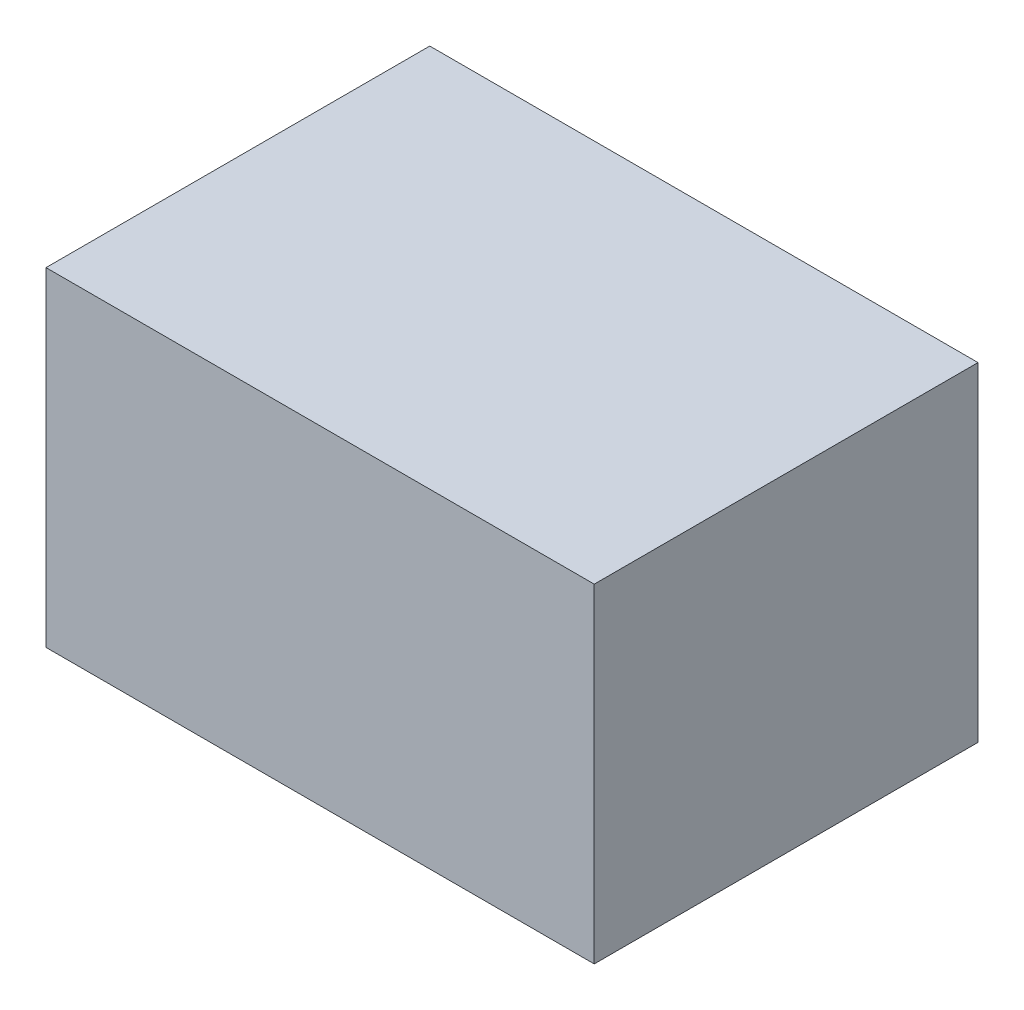
ISO-10303-21;
HEADER;
FILE_DESCRIPTION(('STEP AP214'),'2;1');
FILE_NAME('part.step','',(''),(''),'','','');
FILE_SCHEMA(('AUTOMOTIVE_DESIGN { 1 0 10303 214 1 1 1 1 }'));
ENDSEC;
DATA;
#1=APPLICATION_CONTEXT('core data for automotive mechanical design processes');
#2=APPLICATION_PROTOCOL_DEFINITION('international standard','automotive_design',2000,#1);
#3=PRODUCT_CONTEXT('',#1,'mechanical');
#4=PRODUCT('Part','Part','',(#3));
#5=PRODUCT_RELATED_PRODUCT_CATEGORY('part','',(#4));
#6=PRODUCT_DEFINITION_FORMATION('','',#4);
#7=PRODUCT_DEFINITION_CONTEXT('part definition',#1,'design');
#8=PRODUCT_DEFINITION('design','',#6,#7);
#9=PRODUCT_DEFINITION_SHAPE('','',#8);
#10=(LENGTH_UNIT() NAMED_UNIT(*) SI_UNIT(.MILLI.,.METRE.));
#11=(NAMED_UNIT(*) PLANE_ANGLE_UNIT() SI_UNIT($,.RADIAN.));
#12=(NAMED_UNIT(*) SI_UNIT($,.STERADIAN.) SOLID_ANGLE_UNIT());
#13=UNCERTAINTY_MEASURE_WITH_UNIT(LENGTH_MEASURE(1.E-05),#10,'distance_accuracy_value','');
#14=(GEOMETRIC_REPRESENTATION_CONTEXT(3) GLOBAL_UNCERTAINTY_ASSIGNED_CONTEXT((#13)) GLOBAL_UNIT_ASSIGNED_CONTEXT((#10,
#11,#12)) REPRESENTATION_CONTEXT('',''));
#15=CARTESIAN_POINT('',(0.,0.,0.));
#16=DIRECTION('',(0.,0.,1.));
#17=DIRECTION('',(1.,0.,0.));
#18=AXIS2_PLACEMENT_3D('',#15,#16,#17);
#19=CARTESIAN_POINT('',(10.,0.,0.));
#20=DIRECTION('',(0.,0.,-1.));
#21=DIRECTION('',(-1.,0.,0.));
#22=AXIS2_PLACEMENT_3D('',#19,#20,#21);
#23=PLANE('',#22);
#24=DIRECTION('',(0.,-1.,0.));
#25=VECTOR('',#24,1.);
#26=CARTESIAN_POINT('',(0.,0.,0.));
#27=LINE('',#26,#25);
#28=CARTESIAN_POINT('',(0.,6.,0.));
#29=VERTEX_POINT('',#28);
#30=CARTESIAN_POINT('',(0.,0.,0.));
#31=VERTEX_POINT('',#30);
#32=EDGE_CURVE('E107',#29,#31,#27,.T.);
#33=ORIENTED_EDGE('',*,*,#32,.T.);
#34=DIRECTION('',(-1.,0.,0.));
#35=VECTOR('',#34,1.);
#36=CARTESIAN_POINT('',(10.,0.,0.));
#37=LINE('',#36,#35);
#38=CARTESIAN_POINT('',(10.,0.,0.));
#39=VERTEX_POINT('',#38);
#40=EDGE_CURVE('E11',#39,#31,#37,.T.);
#41=ORIENTED_EDGE('',*,*,#40,.F.);
#42=DIRECTION('',(0.,-1.,0.));
#43=VECTOR('',#42,1.);
#44=CARTESIAN_POINT('',(10.,0.,0.));
#45=LINE('',#44,#43);
#46=CARTESIAN_POINT('',(10.,6.,0.));
#47=VERTEX_POINT('',#46);
#48=EDGE_CURVE('E91',#47,#39,#45,.T.);
#49=ORIENTED_EDGE('',*,*,#48,.F.);
#50=DIRECTION('',(-1.,0.,0.));
#51=VECTOR('',#50,1.);
#52=CARTESIAN_POINT('',(10.,6.,0.));
#53=LINE('',#52,#51);
#54=EDGE_CURVE('E103',#47,#29,#53,.T.);
#55=ORIENTED_EDGE('',*,*,#54,.T.);
#56=EDGE_LOOP('',(#33,#41,#49,#55));
#57=FACE_BOUND('',#56,.T.);
#58=ADVANCED_FACE('F39',(#57),#23,.F.);
#59=CARTESIAN_POINT('',(10.,0.,0.));
#60=DIRECTION('',(0.,1.,0.));
#61=DIRECTION('',(0.,0.,1.));
#62=AXIS2_PLACEMENT_3D('',#59,#60,#61);
#63=PLANE('',#62);
#64=DIRECTION('',(0.,0.,-1.));
#65=VECTOR('',#64,1.);
#66=CARTESIAN_POINT('',(0.,0.,0.));
#67=LINE('',#66,#65);
#68=CARTESIAN_POINT('',(0.,0.,-7.));
#69=VERTEX_POINT('',#68);
#70=EDGE_CURVE('E96',#31,#69,#67,.T.);
#71=ORIENTED_EDGE('',*,*,#70,.T.);
#72=DIRECTION('',(-1.,0.,0.));
#73=VECTOR('',#72,1.);
#74=CARTESIAN_POINT('',(10.,0.,-7.));
#75=LINE('',#74,#73);
#76=CARTESIAN_POINT('',(10.,0.,-7.));
#77=VERTEX_POINT('',#76);
#78=EDGE_CURVE('E48',#77,#69,#75,.T.);
#79=ORIENTED_EDGE('',*,*,#78,.F.);
#80=DIRECTION('',(0.,0.,-1.));
#81=VECTOR('',#80,1.);
#82=CARTESIAN_POINT('',(10.,0.,0.));
#83=LINE('',#82,#81);
#84=EDGE_CURVE('E86',#39,#77,#83,.T.);
#85=ORIENTED_EDGE('',*,*,#84,.F.);
#86=ORIENTED_EDGE('',*,*,#40,.T.);
#87=EDGE_LOOP('',(#71,#79,#85,#86));
#88=FACE_BOUND('',#87,.T.);
#89=ADVANCED_FACE('F95',(#88),#63,.F.);
#90=CARTESIAN_POINT('',(10.,0.,-7.));
#91=DIRECTION('',(0.,0.,1.));
#92=DIRECTION('',(1.,0.,0.));
#93=AXIS2_PLACEMENT_3D('',#90,#91,#92);
#94=PLANE('',#93);
#95=DIRECTION('',(0.,1.,0.));
#96=VECTOR('',#95,1.);
#97=CARTESIAN_POINT('',(0.,0.,-7.));
#98=LINE('',#97,#96);
#99=CARTESIAN_POINT('',(0.,6.,-7.));
#100=VERTEX_POINT('',#99);
#101=EDGE_CURVE('E73',#69,#100,#98,.T.);
#102=ORIENTED_EDGE('',*,*,#101,.T.);
#103=DIRECTION('',(-1.,0.,0.));
#104=VECTOR('',#103,1.);
#105=CARTESIAN_POINT('',(10.,6.,-7.));
#106=LINE('',#105,#104);
#107=CARTESIAN_POINT('',(10.,6.,-7.));
#108=VERTEX_POINT('',#107);
#109=EDGE_CURVE('E98',#108,#100,#106,.T.);
#110=ORIENTED_EDGE('',*,*,#109,.F.);
#111=DIRECTION('',(0.,1.,0.));
#112=VECTOR('',#111,1.);
#113=CARTESIAN_POINT('',(10.,0.,-7.));
#114=LINE('',#113,#112);
#115=EDGE_CURVE('E89',#77,#108,#114,.T.);
#116=ORIENTED_EDGE('',*,*,#115,.F.);
#117=ORIENTED_EDGE('',*,*,#78,.T.);
#118=EDGE_LOOP('',(#102,#110,#116,#117));
#119=FACE_BOUND('',#118,.T.);
#120=ADVANCED_FACE('F99',(#119),#94,.F.);
#121=CARTESIAN_POINT('',(10.,6.,0.));
#122=DIRECTION('',(0.,-1.,0.));
#123=DIRECTION('',(0.,0.,-1.));
#124=AXIS2_PLACEMENT_3D('',#121,#122,#123);
#125=PLANE('',#124);
#126=DIRECTION('',(0.,0.,1.));
#127=VECTOR('',#126,1.);
#128=CARTESIAN_POINT('',(0.,6.,0.));
#129=LINE('',#128,#127);
#130=EDGE_CURVE('E79',#100,#29,#129,.T.);
#131=ORIENTED_EDGE('',*,*,#130,.T.);
#132=ORIENTED_EDGE('',*,*,#54,.F.);
#133=DIRECTION('',(0.,0.,1.));
#134=VECTOR('',#133,1.);
#135=CARTESIAN_POINT('',(10.,6.,0.));
#136=LINE('',#135,#134);
#137=EDGE_CURVE('E56',#108,#47,#136,.T.);
#138=ORIENTED_EDGE('',*,*,#137,.F.);
#139=ORIENTED_EDGE('',*,*,#109,.T.);
#140=EDGE_LOOP('',(#131,#132,#138,#139));
#141=FACE_BOUND('',#140,.T.);
#142=ADVANCED_FACE('F120',(#141),#125,.F.);
#143=CARTESIAN_POINT('',(10.,0.,0.));
#144=DIRECTION('',(-1.,0.,0.));
#145=DIRECTION('',(0.,0.,1.));
#146=AXIS2_PLACEMENT_3D('',#143,#144,#145);
#147=PLANE('',#146);
#148=ORIENTED_EDGE('',*,*,#48,.T.);
#149=ORIENTED_EDGE('',*,*,#84,.T.);
#150=ORIENTED_EDGE('',*,*,#115,.T.);
#151=ORIENTED_EDGE('',*,*,#137,.T.);
#152=EDGE_LOOP('',(#148,#149,#150,#151));
#153=FACE_BOUND('',#152,.T.);
#154=ADVANCED_FACE('F87',(#153),#147,.F.);
#155=CARTESIAN_POINT('',(0.,0.,0.));
#156=DIRECTION('',(-1.,0.,0.));
#157=DIRECTION('',(0.,0.,1.));
#158=AXIS2_PLACEMENT_3D('',#155,#156,#157);
#159=PLANE('',#158);
#160=ORIENTED_EDGE('',*,*,#32,.F.);
#161=ORIENTED_EDGE('',*,*,#130,.F.);
#162=ORIENTED_EDGE('',*,*,#101,.F.);
#163=ORIENTED_EDGE('',*,*,#70,.F.);
#164=EDGE_LOOP('',(#160,#161,#162,#163));
#165=FACE_BOUND('',#164,.T.);
#166=ADVANCED_FACE('F123',(#165),#159,.T.);
#167=CLOSED_SHELL('',(#58,#89,#120,#142,#154,#166));
#168=MANIFOLD_SOLID_BREP('B2',#167);
#169=ADVANCED_BREP_SHAPE_REPRESENTATION('',(#18,#168),#14);
#170=SHAPE_DEFINITION_REPRESENTATION(#9,#169);
ENDSEC;
END-ISO-10303-21;
